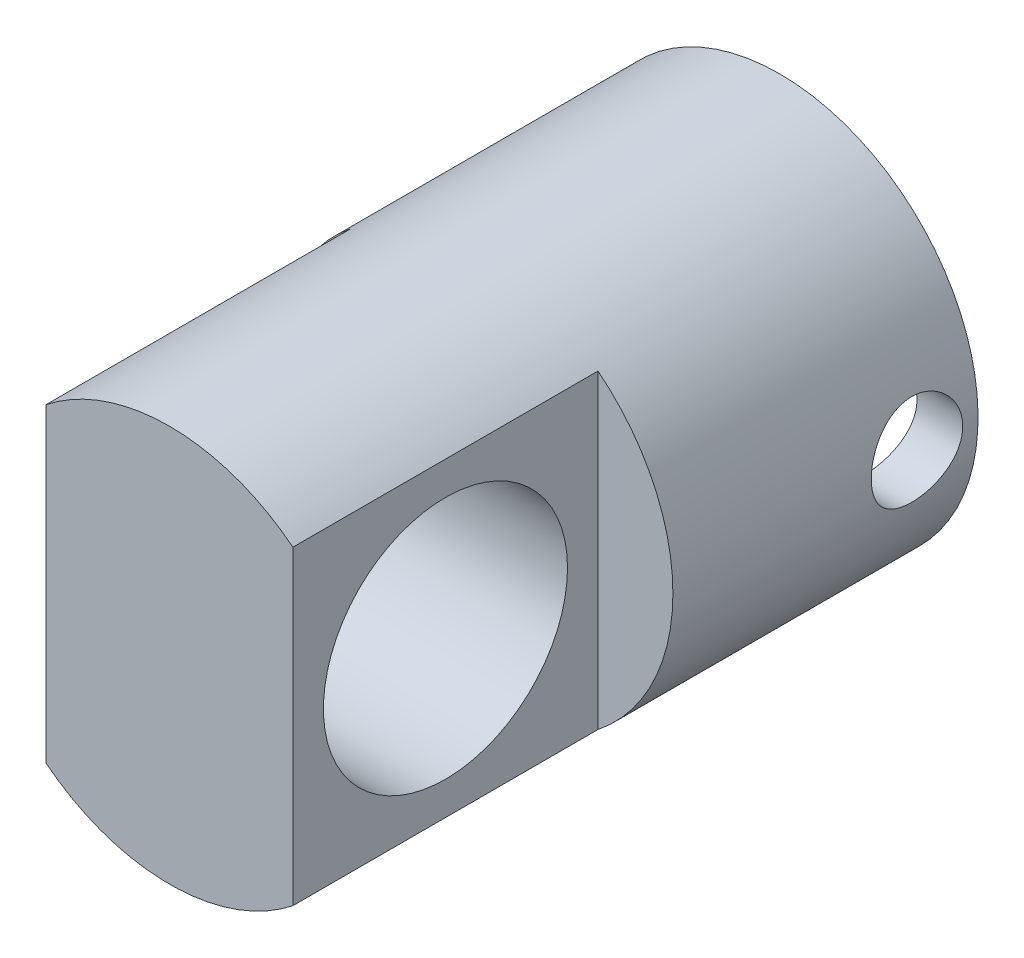
ISO-10303-21;
HEADER;
FILE_DESCRIPTION(('STEP AP214'),'2;1');
FILE_NAME('part.step','',(''),(''),'','','');
FILE_SCHEMA(('AUTOMOTIVE_DESIGN { 1 0 10303 214 1 1 1 1 }'));
ENDSEC;
DATA;
#1=APPLICATION_CONTEXT('core data for automotive mechanical design processes');
#2=APPLICATION_PROTOCOL_DEFINITION('international standard','automotive_design',2000,#1);
#3=PRODUCT_CONTEXT('',#1,'mechanical');
#4=PRODUCT('Part','Part','',(#3));
#5=PRODUCT_RELATED_PRODUCT_CATEGORY('part','',(#4));
#6=PRODUCT_DEFINITION_FORMATION('','',#4);
#7=PRODUCT_DEFINITION_CONTEXT('part definition',#1,'design');
#8=PRODUCT_DEFINITION('design','',#6,#7);
#9=PRODUCT_DEFINITION_SHAPE('','',#8);
#10=(LENGTH_UNIT() NAMED_UNIT(*) SI_UNIT(.MILLI.,.METRE.));
#11=(NAMED_UNIT(*) PLANE_ANGLE_UNIT() SI_UNIT($,.RADIAN.));
#12=(NAMED_UNIT(*) SI_UNIT($,.STERADIAN.) SOLID_ANGLE_UNIT());
#13=UNCERTAINTY_MEASURE_WITH_UNIT(LENGTH_MEASURE(1.E-05),#10,'distance_accuracy_value','');
#14=(GEOMETRIC_REPRESENTATION_CONTEXT(3) GLOBAL_UNCERTAINTY_ASSIGNED_CONTEXT((#13)) GLOBAL_UNIT_ASSIGNED_CONTEXT((#10,
#11,#12)) REPRESENTATION_CONTEXT('',''));
#15=CARTESIAN_POINT('',(0.,0.,0.));
#16=DIRECTION('',(0.,0.,1.));
#17=DIRECTION('',(1.,0.,0.));
#18=AXIS2_PLACEMENT_3D('',#15,#16,#17);
#19=CARTESIAN_POINT('',(0.,13.,-25.));
#20=DIRECTION('',(0.,0.,-1.));
#21=DIRECTION('',(0.,1.,0.));
#22=AXIS2_PLACEMENT_3D('',#19,#20,#21);
#23=CYLINDRICAL_SURFACE('',#22,13.);
#24=CARTESIAN_POINT('',(0.,13.,0.));
#25=DIRECTION('',(0.,0.,-1.));
#26=DIRECTION('',(0.,1.,0.));
#27=AXIS2_PLACEMENT_3D('',#24,#25,#26);
#28=CIRCLE('',#27,13.);
#29=CARTESIAN_POINT('',(-8.09151168124387,23.1748434244608,0.));
#30=VERTEX_POINT('',#29);
#31=CARTESIAN_POINT('',(8.09151168124387,23.1748434244608,0.));
#32=VERTEX_POINT('',#31);
#33=EDGE_CURVE('E49',#30,#32,#28,.T.);
#34=ORIENTED_EDGE('',*,*,#33,.T.);
#35=DIRECTION('',(0.,0.,1.));
#36=VECTOR('',#35,1.);
#37=CARTESIAN_POINT('',(8.09151168124387,23.1748434244608,-20.));
#38=LINE('',#37,#36);
#39=CARTESIAN_POINT('',(8.09151168124387,23.1748434244608,-20.));
#40=VERTEX_POINT('',#39);
#41=EDGE_CURVE('E65',#40,#32,#38,.T.);
#42=ORIENTED_EDGE('',*,*,#41,.F.);
#43=CARTESIAN_POINT('',(0.,13.,-20.));
#44=DIRECTION('',(0.,0.,1.));
#45=DIRECTION('',(1.,0.,0.));
#46=AXIS2_PLACEMENT_3D('',#43,#44,#45);
#47=CIRCLE('',#46,13.);
#48=CARTESIAN_POINT('',(8.09151168124387,2.82515657553916,-20.));
#49=VERTEX_POINT('',#48);
#50=EDGE_CURVE('E84',#49,#40,#47,.T.);
#51=ORIENTED_EDGE('',*,*,#50,.F.);
#52=DIRECTION('',(0.,0.,1.));
#53=VECTOR('',#52,1.);
#54=CARTESIAN_POINT('',(8.09151168124387,2.82515657553916,-20.));
#55=LINE('',#54,#53);
#56=CARTESIAN_POINT('',(8.09151168124387,2.82515657553916,0.));
#57=VERTEX_POINT('',#56);
#58=EDGE_CURVE('E92',#49,#57,#55,.T.);
#59=ORIENTED_EDGE('',*,*,#58,.T.);
#60=CARTESIAN_POINT('',(-8.09151168124387,2.82515657553916,0.));
#61=VERTEX_POINT('',#60);
#62=EDGE_CURVE('E11',#57,#61,#28,.T.);
#63=ORIENTED_EDGE('',*,*,#62,.T.);
#64=DIRECTION('',(0.,0.,1.));
#65=VECTOR('',#64,1.);
#66=CARTESIAN_POINT('',(-8.09151168124387,2.82515657553916,-20.));
#67=LINE('',#66,#65);
#68=CARTESIAN_POINT('',(-8.09151168124387,2.82515657553916,-20.));
#69=VERTEX_POINT('',#68);
#70=EDGE_CURVE('E57',#69,#61,#67,.T.);
#71=ORIENTED_EDGE('',*,*,#70,.F.);
#72=CARTESIAN_POINT('',(0.,13.,-20.));
#73=DIRECTION('',(0.,0.,1.));
#74=DIRECTION('',(1.,0.,0.));
#75=AXIS2_PLACEMENT_3D('',#72,#73,#74);
#76=CIRCLE('',#75,13.);
#77=CARTESIAN_POINT('',(-8.09151168124387,23.1748434244608,-20.));
#78=VERTEX_POINT('',#77);
#79=EDGE_CURVE('E105',#78,#69,#76,.T.);
#80=ORIENTED_EDGE('',*,*,#79,.F.);
#81=DIRECTION('',(0.,0.,1.));
#82=VECTOR('',#81,1.);
#83=CARTESIAN_POINT('',(-8.09151168124387,23.1748434244608,-20.));
#84=LINE('',#83,#82);
#85=EDGE_CURVE('E109',#78,#30,#84,.T.);
#86=ORIENTED_EDGE('',*,*,#85,.T.);
#87=EDGE_LOOP('',(#34,#42,#51,#59,#63,#71,#80,#86));
#88=FACE_BOUND('',#87,.T.);
#89=CARTESIAN_POINT('',(0.,13.,-40.));
#90=DIRECTION('',(0.,0.,-1.));
#91=DIRECTION('',(0.,1.,0.));
#92=AXIS2_PLACEMENT_3D('',#89,#90,#91);
#93=CIRCLE('',#92,13.);
#94=CARTESIAN_POINT('',(0.,26.,-40.));
#95=VERTEX_POINT('',#94);
#96=EDGE_CURVE('E119',#95,#95,#93,.T.);
#97=ORIENTED_EDGE('',*,*,#96,.F.);
#98=EDGE_LOOP('',(#97));
#99=FACE_BOUND('',#98,.T.);
#100=CARTESIAN_POINT('',(-13.,13.,-33.));
#101=CARTESIAN_POINT('',(-12.9999969906573,13.1661523449527,-33.0000053307118));
#102=CARTESIAN_POINT('',(-12.9967824842909,13.3323672059736,-33.0138498536222));
#103=CARTESIAN_POINT('',(-12.9842700075106,13.6600598664932,-33.0687952857713));
#104=CARTESIAN_POINT('',(-12.9749680237034,13.8215344673667,-33.1099141768828));
#105=CARTESIAN_POINT('',(-12.9513142129353,14.1349648012989,-33.2180393978818));
#106=CARTESIAN_POINT('',(-12.936967958219,14.2869308208639,-33.2850171702627));
#107=CARTESIAN_POINT('',(-12.904766336637,14.577465910561,-33.4428645301367));
#108=CARTESIAN_POINT('',(-12.8869109815535,14.7160350256719,-33.5337340374119));
#109=CARTESIAN_POINT('',(-12.8492864660987,14.9783047062464,-33.7384905033544));
#110=CARTESIAN_POINT('',(-12.8294913730763,15.1017335843224,-33.8527207234048));
#111=CARTESIAN_POINT('',(-12.7903971901517,15.3278612079539,-34.1002198531428));
#112=CARTESIAN_POINT('',(-12.7710981487534,15.4305579329983,-34.2334906163216));
#113=CARTESIAN_POINT('',(-12.7349234835873,15.6135339150511,-34.51733385512));
#114=CARTESIAN_POINT('',(-12.7180809816988,15.6935185095554,-34.6681008819513));
#115=CARTESIAN_POINT('',(-12.6891009206901,15.8269079066015,-34.9813901973035));
#116=CARTESIAN_POINT('',(-12.6769627300499,15.8803162770841,-35.1439109044991));
#117=CARTESIAN_POINT('',(-12.659030692131,15.9581284851719,-35.4731316031644));
#118=CARTESIAN_POINT('',(-12.6531311408672,15.9830161899359,-35.6397113467331));
#119=CARTESIAN_POINT('',(-12.6480272975283,16.0045861409287,-35.9747781740706));
#120=CARTESIAN_POINT('',(-12.6488220853967,16.0012722631264,-36.1432649925563));
#121=CARTESIAN_POINT('',(-12.6569216667427,15.9669212657146,-36.4737256156487));
#122=CARTESIAN_POINT('',(-12.6640932250769,15.9364515063037,-36.6357621626882));
#123=CARTESIAN_POINT('',(-12.683927027642,15.8495548295868,-36.9523595838029));
#124=CARTESIAN_POINT('',(-12.6965896109567,15.7931263092534,-37.1069199955541));
#125=CARTESIAN_POINT('',(-12.726106644567,15.655406981501,-37.4057453432819));
#126=CARTESIAN_POINT('',(-12.7429968648251,15.5739025849305,-37.549908161822));
#127=CARTESIAN_POINT('',(-12.7790447936328,15.3884949795051,-37.8227184725787));
#128=CARTESIAN_POINT('',(-12.7982028439228,15.2845883929106,-37.951363620518));
#129=CARTESIAN_POINT('',(-12.8371955528176,15.054346421729,-38.1927479001019));
#130=CARTESIAN_POINT('',(-12.8570353769547,14.9275299016901,-38.3050277702499));
#131=CARTESIAN_POINT('',(-12.8947363213875,14.6566372821068,-38.5068061419507));
#132=CARTESIAN_POINT('',(-12.91259739752,14.51256079749,-38.5963041350972));
#133=CARTESIAN_POINT('',(-12.94439708166,14.2106425559447,-38.7501118282866));
#134=CARTESIAN_POINT('',(-12.9583254640484,14.0527662865885,-38.8143560313853));
#135=CARTESIAN_POINT('',(-12.980615159728,13.7280647925052,-38.9152722873901));
#136=CARTESIAN_POINT('',(-12.9889773764326,13.5612410247485,-38.9519488147769));
#137=CARTESIAN_POINT('',(-12.999062058904,13.2273146478633,-38.9960083006963));
#138=CARTESIAN_POINT('',(-13.0009265305377,13.0602988900254,-39.0040178721195));
#139=CARTESIAN_POINT('',(-12.9982059982626,12.7273152568415,-38.9922219704814));
#140=CARTESIAN_POINT('',(-12.9936214841662,12.5613473028745,-38.972418609864));
#141=CARTESIAN_POINT('',(-12.9786082469926,12.2372841924039,-38.9060776067885));
#142=CARTESIAN_POINT('',(-12.968252478837,12.0791170702486,-38.8598735173657));
#143=CARTESIAN_POINT('',(-12.9428582085761,11.7727807550367,-38.7424168221512));
#144=CARTESIAN_POINT('',(-12.9278192778858,11.6246124785468,-38.6711619237282));
#145=CARTESIAN_POINT('',(-12.8943799217624,11.3399247697796,-38.5043547121581));
#146=CARTESIAN_POINT('',(-12.8759307059183,11.2036231794074,-38.4084406162299));
#147=CARTESIAN_POINT('',(-12.837807838285,10.9488256390363,-38.1955087652826));
#148=CARTESIAN_POINT('',(-12.8181340084537,10.8303322867044,-38.0784879369158));
#149=CARTESIAN_POINT('',(-12.7792809496474,10.61199794334,-37.8237752282431));
#150=CARTESIAN_POINT('',(-12.7601203499969,10.5125931282204,-37.6857060706494));
#151=CARTESIAN_POINT('',(-12.7249237700036,10.3383752910705,-37.3944682395653));
#152=CARTESIAN_POINT('',(-12.7088876507294,10.2635611755028,-37.2413002379075));
#153=CARTESIAN_POINT('',(-12.6819190230073,10.1411786626399,-36.9250480231647));
#154=CARTESIAN_POINT('',(-12.6709569224205,10.0934519103925,-36.762027740679));
#155=CARTESIAN_POINT('',(-12.6553320099168,10.0261493864882,-36.4299920143535));
#156=CARTESIAN_POINT('',(-12.6506680575041,10.0065685180124,-36.2609776616361));
#157=CARTESIAN_POINT('',(-12.6482450687886,9.99634927968086,-35.9261635458855));
#158=CARTESIAN_POINT('',(-12.6503205850391,10.0050174425696,-35.7603857787004));
#159=CARTESIAN_POINT('',(-12.6607654071459,10.0494862803833,-35.4327226426661));
#160=CARTESIAN_POINT('',(-12.6691346207273,10.0852865575119,-35.2708372167854));
#161=CARTESIAN_POINT('',(-12.6911387833219,10.1826515855969,-34.9561801784171));
#162=CARTESIAN_POINT('',(-12.7047508718617,10.2441045793285,-34.8033722785881));
#163=CARTESIAN_POINT('',(-12.7357136622436,10.390938355458,-34.5101363869175));
#164=CARTESIAN_POINT('',(-12.7530648031611,10.4763219483697,-34.3697098517453));
#165=CARTESIAN_POINT('',(-12.7900365874876,10.6708464096747,-34.1018289428198));
#166=CARTESIAN_POINT('',(-12.8096993736488,10.7804767593342,-33.9747357609008));
#167=CARTESIAN_POINT('',(-12.8488080487622,11.0194045708136,-33.7405235047234));
#168=CARTESIAN_POINT('',(-12.8682538861233,11.1487066079512,-33.6334090901394));
#169=CARTESIAN_POINT('',(-12.9050799859908,11.4256161344769,-33.4406654641024));
#170=CARTESIAN_POINT('',(-12.9224254113505,11.5734662618302,-33.3553777634204));
#171=CARTESIAN_POINT('',(-12.9527409110575,11.8817807170492,-33.2110017011828));
#172=CARTESIAN_POINT('',(-12.9657144587282,12.0422349057961,-33.1518925297941));
#173=CARTESIAN_POINT('',(-12.9836544679345,12.3355792516024,-33.0714430528885));
#174=CARTESIAN_POINT('',(-12.989744579336,12.466947265358,-33.044705457946));
#175=CARTESIAN_POINT('',(-12.9979184490222,12.7321967394383,-33.0089822667706));
#176=CARTESIAN_POINT('',(-13.0000024255872,12.8660780624203,-32.9999957033453));
#177=CARTESIAN_POINT('',(-13.,13.,-33.));
#178=B_SPLINE_CURVE_WITH_KNOTS('',3,(#100,#101,#102,#103,#104,#105,#106,#107,#108,#109,#110,
#111,#112,#113,#114,#115,#116,#117,#118,#119,#120,#121,#122,#123,#124,#125,#126,#127,#128,#129,
#130,#131,#132,#133,#134,#135,#136,#137,#138,#139,#140,#141,#142,#143,#144,#145,#146,#147,#148,
#149,#150,#151,#152,#153,#154,#155,#156,#157,#158,#159,#160,#161,#162,#163,#164,#165,#166,#167,
#168,#169,#170,#171,#172,#173,#174,#175,#176,#177),.UNSPECIFIED.,.T.,.F.,(4,2,2,2,2,2,2,2,2,2,2,
2,2,2,2,2,2,2,2,2,2,2,2,2,2,2,2,2,2,2,2,2,2,2,2,2,2,2,4),(0.,0.497966622434227,
0.996261878862196,1.49400840494549,1.9917532598344,2.49741860444443,3.00313320634928,
3.51513680218821,4.02707164139241,4.53018632285288,5.03323185836014,5.52600755521466,
6.01881368645779,6.51593939429341,7.01314010983494,7.52235052563831,8.03157230411895,
8.54210619550815,9.05255720476822,9.55178002870641,10.0509649377955,10.5439782351977,
11.0370366645577,11.5377886750691,12.0386136589455,12.5497908111456,13.0609452284513,
13.5690797726974,14.0771222894149,14.5727880288599,15.0684465012649,15.5619677862172,
16.0555470567626,16.5601864742807,17.0649434427466,17.5771721946325,18.088993031651,
18.4903854337741,18.8917559648093),.UNSPECIFIED.);
#179=CARTESIAN_POINT('',(-13.,13.,-33.));
#180=VERTEX_POINT('',#179);
#181=EDGE_CURVE('E143',#180,#180,#178,.T.);
#182=ORIENTED_EDGE('',*,*,#181,.F.);
#183=EDGE_LOOP('',(#182));
#184=FACE_BOUND('',#183,.T.);
#185=CARTESIAN_POINT('',(13.,13.,-33.));
#186=CARTESIAN_POINT('',(12.9999969906573,12.8338476550473,-33.0000053307118));
#187=CARTESIAN_POINT('',(12.9967824842909,12.6676327940263,-33.0138498536222));
#188=CARTESIAN_POINT('',(12.9842700075106,12.3399401335067,-33.0687952857713));
#189=CARTESIAN_POINT('',(12.9749680237034,12.1784655326333,-33.1099141768828));
#190=CARTESIAN_POINT('',(12.9513142129353,11.8650351987011,-33.2180393978818));
#191=CARTESIAN_POINT('',(12.936967958219,11.7130691791361,-33.2850171702627));
#192=CARTESIAN_POINT('',(12.904766336637,11.422534089439,-33.4428645301367));
#193=CARTESIAN_POINT('',(12.8869109815535,11.2839649743281,-33.5337340374119));
#194=CARTESIAN_POINT('',(12.8492864660987,11.0216952937536,-33.7384905033544));
#195=CARTESIAN_POINT('',(12.8294913730763,10.8982664156776,-33.8527207234048));
#196=CARTESIAN_POINT('',(12.7903971901517,10.6721387920461,-34.1002198531428));
#197=CARTESIAN_POINT('',(12.7710981487534,10.5694420670017,-34.2334906163216));
#198=CARTESIAN_POINT('',(12.7349234835873,10.3864660849489,-34.51733385512));
#199=CARTESIAN_POINT('',(12.7180809816988,10.3064814904445,-34.6681008819513));
#200=CARTESIAN_POINT('',(12.6891009206901,10.1730920933985,-34.9813901973035));
#201=CARTESIAN_POINT('',(12.6769627300499,10.1196837229159,-35.1439109044991));
#202=CARTESIAN_POINT('',(12.659030692131,10.0418715148281,-35.4731316031644));
#203=CARTESIAN_POINT('',(12.6531311408672,10.0169838100641,-35.6397113467331));
#204=CARTESIAN_POINT('',(12.6480272975283,9.99541385907125,-35.9747781740706));
#205=CARTESIAN_POINT('',(12.6488220853967,9.99872773687357,-36.1432649925563));
#206=CARTESIAN_POINT('',(12.6569216667427,10.0330787342853,-36.4737256156487));
#207=CARTESIAN_POINT('',(12.6640932250769,10.0635484936963,-36.6357621626882));
#208=CARTESIAN_POINT('',(12.683927027642,10.1504451704132,-36.9523595838029));
#209=CARTESIAN_POINT('',(12.6965896109567,10.2068736907466,-37.1069199955541));
#210=CARTESIAN_POINT('',(12.726106644567,10.344593018499,-37.4057453432819));
#211=CARTESIAN_POINT('',(12.7429968648251,10.4260974150694,-37.549908161822));
#212=CARTESIAN_POINT('',(12.7790447936328,10.6115050204949,-37.8227184725787));
#213=CARTESIAN_POINT('',(12.7982028439228,10.7154116070894,-37.951363620518));
#214=CARTESIAN_POINT('',(12.8371955528176,10.9456535782709,-38.1927479001019));
#215=CARTESIAN_POINT('',(12.8570353769547,11.0724700983099,-38.3050277702499));
#216=CARTESIAN_POINT('',(12.8947363213875,11.3433627178932,-38.5068061419507));
#217=CARTESIAN_POINT('',(12.91259739752,11.4874392025099,-38.5963041350972));
#218=CARTESIAN_POINT('',(12.94439708166,11.7893574440552,-38.7501118282866));
#219=CARTESIAN_POINT('',(12.9583254640484,11.9472337134115,-38.8143560313853));
#220=CARTESIAN_POINT('',(12.980615159728,12.2719352074948,-38.9152722873901));
#221=CARTESIAN_POINT('',(12.9889773764326,12.4387589752515,-38.9519488147769));
#222=CARTESIAN_POINT('',(12.999062058904,12.7726853521367,-38.9960083006963));
#223=CARTESIAN_POINT('',(13.0009265305377,12.9397011099745,-39.0040178721195));
#224=CARTESIAN_POINT('',(12.9982059982626,13.2726847431584,-38.9922219704814));
#225=CARTESIAN_POINT('',(12.9936214841662,13.4386526971255,-38.972418609864));
#226=CARTESIAN_POINT('',(12.9786082469926,13.762715807596,-38.9060776067885));
#227=CARTESIAN_POINT('',(12.968252478837,13.9208829297514,-38.8598735173657));
#228=CARTESIAN_POINT('',(12.9428582085761,14.2272192449633,-38.7424168221512));
#229=CARTESIAN_POINT('',(12.9278192778858,14.3753875214532,-38.6711619237282));
#230=CARTESIAN_POINT('',(12.8943799217624,14.6600752302203,-38.5043547121581));
#231=CARTESIAN_POINT('',(12.8759307059183,14.7963768205926,-38.4084406162299));
#232=CARTESIAN_POINT('',(12.837807838285,15.0511743609636,-38.1955087652826));
#233=CARTESIAN_POINT('',(12.8181340084537,15.1696677132956,-38.0784879369158));
#234=CARTESIAN_POINT('',(12.7792809496474,15.38800205666,-37.8237752282431));
#235=CARTESIAN_POINT('',(12.7601203499969,15.4874068717795,-37.6857060706494));
#236=CARTESIAN_POINT('',(12.7249237700036,15.6616247089294,-37.3944682395653));
#237=CARTESIAN_POINT('',(12.7088876507294,15.7364388244972,-37.2413002379075));
#238=CARTESIAN_POINT('',(12.6819190230073,15.85882133736,-36.9250480231647));
#239=CARTESIAN_POINT('',(12.6709569224205,15.9065480896074,-36.762027740679));
#240=CARTESIAN_POINT('',(12.6553320099168,15.9738506135118,-36.4299920143535));
#241=CARTESIAN_POINT('',(12.6506680575041,15.9934314819875,-36.2609776616361));
#242=CARTESIAN_POINT('',(12.6482450687886,16.0036507203191,-35.9261635458855));
#243=CARTESIAN_POINT('',(12.6503205850391,15.9949825574303,-35.7603857787004));
#244=CARTESIAN_POINT('',(12.6607654071459,15.9505137196167,-35.4327226426661));
#245=CARTESIAN_POINT('',(12.6691346207273,15.9147134424881,-35.2708372167854));
#246=CARTESIAN_POINT('',(12.6911387833219,15.8173484144031,-34.9561801784171));
#247=CARTESIAN_POINT('',(12.7047508718617,15.7558954206715,-34.8033722785881));
#248=CARTESIAN_POINT('',(12.7357136622436,15.6090616445419,-34.5101363869175));
#249=CARTESIAN_POINT('',(12.7530648031611,15.5236780516303,-34.3697098517453));
#250=CARTESIAN_POINT('',(12.7900365874876,15.3291535903253,-34.1018289428198));
#251=CARTESIAN_POINT('',(12.8096993736488,15.2195232406657,-33.9747357609008));
#252=CARTESIAN_POINT('',(12.8488080487622,14.9805954291864,-33.7405235047234));
#253=CARTESIAN_POINT('',(12.8682538861233,14.8512933920488,-33.6334090901394));
#254=CARTESIAN_POINT('',(12.9050799859908,14.5743838655231,-33.4406654641024));
#255=CARTESIAN_POINT('',(12.9224254113505,14.4265337381698,-33.3553777634204));
#256=CARTESIAN_POINT('',(12.9527409110575,14.1182192829507,-33.2110017011828));
#257=CARTESIAN_POINT('',(12.9657144587282,13.9577650942039,-33.1518925297941));
#258=CARTESIAN_POINT('',(12.9836544679345,13.6644207483975,-33.0714430528885));
#259=CARTESIAN_POINT('',(12.989744579336,13.533052734642,-33.044705457946));
#260=CARTESIAN_POINT('',(12.9979184490222,13.2678032605617,-33.0089822667706));
#261=CARTESIAN_POINT('',(13.0000024255872,13.1339219375796,-32.9999957033453));
#262=CARTESIAN_POINT('',(13.,13.,-33.));
#263=B_SPLINE_CURVE_WITH_KNOTS('',3,(#185,#186,#187,#188,#189,#190,#191,#192,#193,#194,#195,
#196,#197,#198,#199,#200,#201,#202,#203,#204,#205,#206,#207,#208,#209,#210,#211,#212,#213,#214,
#215,#216,#217,#218,#219,#220,#221,#222,#223,#224,#225,#226,#227,#228,#229,#230,#231,#232,#233,
#234,#235,#236,#237,#238,#239,#240,#241,#242,#243,#244,#245,#246,#247,#248,#249,#250,#251,#252,
#253,#254,#255,#256,#257,#258,#259,#260,#261,#262),.UNSPECIFIED.,.T.,.F.,(4,2,2,2,2,2,2,2,2,2,2,
2,2,2,2,2,2,2,2,2,2,2,2,2,2,2,2,2,2,2,2,2,2,2,2,2,2,2,4),(0.,0.497966622434227,
0.996261878862196,1.49400840494549,1.9917532598344,2.49741860444443,3.00313320634928,
3.51513680218821,4.02707164139241,4.53018632285288,5.03323185836014,5.52600755521466,
6.01881368645779,6.51593939429341,7.01314010983494,7.52235052563831,8.03157230411895,
8.54210619550815,9.05255720476822,9.55178002870642,10.0509649377955,10.5439782351977,
11.0370366645577,11.5377886750691,12.0386136589455,12.5497908111456,13.0609452284513,
13.5690797726974,14.0771222894149,14.5727880288599,15.0684465012649,15.5619677862172,
16.0555470567626,16.5601864742807,17.0649434427466,17.5771721946325,18.088993031651,
18.4903854337741,18.8917559648093),.UNSPECIFIED.);
#264=CARTESIAN_POINT('',(13.,13.,-33.));
#265=VERTEX_POINT('',#264);
#266=EDGE_CURVE('E148',#265,#265,#263,.T.);
#267=ORIENTED_EDGE('',*,*,#266,.F.);
#268=EDGE_LOOP('',(#267));
#269=FACE_BOUND('',#268,.T.);
#270=ADVANCED_FACE('F35',(#88,#99,#184,#269),#23,.T.);
#271=CARTESIAN_POINT('',(0.,13.,-25.));
#272=DIRECTION('',(0.,0.,-1.));
#273=DIRECTION('',(0.,1.,0.));
#274=AXIS2_PLACEMENT_3D('',#271,#272,#273);
#275=CYLINDRICAL_SURFACE('',#274,10.);
#276=CARTESIAN_POINT('',(0.,13.,-25.));
#277=DIRECTION('',(0.,0.,-1.));
#278=DIRECTION('',(0.,1.,0.));
#279=AXIS2_PLACEMENT_3D('',#276,#277,#278);
#280=CIRCLE('',#279,10.);
#281=CARTESIAN_POINT('',(0.,23.,-25.));
#282=VERTEX_POINT('',#281);
#283=EDGE_CURVE('E99',#282,#282,#280,.T.);
#284=ORIENTED_EDGE('',*,*,#283,.F.);
#285=EDGE_LOOP('',(#284));
#286=FACE_BOUND('',#285,.T.);
#287=CARTESIAN_POINT('',(0.,13.,-40.));
#288=DIRECTION('',(0.,0.,-1.));
#289=DIRECTION('',(0.,1.,0.));
#290=AXIS2_PLACEMENT_3D('',#287,#288,#289);
#291=CIRCLE('',#290,9.99999999999999);
#292=CARTESIAN_POINT('',(0.,23.,-40.));
#293=VERTEX_POINT('',#292);
#294=EDGE_CURVE('E116',#293,#293,#291,.T.);
#295=ORIENTED_EDGE('',*,*,#294,.T.);
#296=EDGE_LOOP('',(#295));
#297=FACE_BOUND('',#296,.T.);
#298=CARTESIAN_POINT('',(-10.,13.,-33.));
#299=CARTESIAN_POINT('',(-9.999998585011,12.8354227744934,-33.0000019949698));
#300=CARTESIAN_POINT('',(-9.99589831387907,12.6708253632969,-33.0135877272479));
#301=CARTESIAN_POINT('',(-9.97994211187381,12.3464237493902,-33.0674427084442));
#302=CARTESIAN_POINT('',(-9.96808386779384,12.1866209911771,-33.1077199160467));
#303=CARTESIAN_POINT('',(-9.93791105003672,11.8765345844909,-33.2134920338205));
#304=CARTESIAN_POINT('',(-9.9196060050085,11.7262372712092,-33.2789497392379));
#305=CARTESIAN_POINT('',(-9.8784421847529,11.4387516378937,-33.4330721861117));
#306=CARTESIAN_POINT('',(-9.85558280384133,11.3015650650606,-33.5217400147908));
#307=CARTESIAN_POINT('',(-9.80701474385548,11.0402564056325,-33.7224480149453));
#308=CARTESIAN_POINT('',(-9.78124767314072,10.9165638575113,-33.8350332517718));
#309=CARTESIAN_POINT('',(-9.73011668420884,10.6895015815335,-34.0792184598204));
#310=CARTESIAN_POINT('',(-9.70475283449002,10.5861352734512,-34.2108216242499));
#311=CARTESIAN_POINT('',(-9.65668227987544,10.4003992455258,-34.4929415060752));
#312=CARTESIAN_POINT('',(-9.63404813327749,10.3185538195557,-34.6438169219815));
#313=CARTESIAN_POINT('',(-9.59487240788062,10.1815721045048,-34.9579785084606));
#314=CARTESIAN_POINT('',(-9.57832936626621,10.1264294016005,-35.1212616878559));
#315=CARTESIAN_POINT('',(-9.55381741676868,10.045967326347,-35.4507805322609));
#316=CARTESIAN_POINT('',(-9.54562138649066,10.0198560753064,-35.6168054877279));
#317=CARTESIAN_POINT('',(-9.53805579499534,9.99572538770655,-35.9510663124335));
#318=CARTESIAN_POINT('',(-9.53868409521142,9.99769914477842,-36.1193016361182));
#319=CARTESIAN_POINT('',(-9.54849488135555,10.0290604560038,-36.446767817217));
#320=CARTESIAN_POINT('',(-9.55736777198281,10.0574558947463,-36.6061045007245));
#321=CARTESIAN_POINT('',(-9.58216712457248,10.1392515914589,-36.9176395725469));
#322=CARTESIAN_POINT('',(-9.59809428264701,10.1926543171672,-37.0698372547487));
#323=CARTESIAN_POINT('',(-9.63545466149946,10.3236794669264,-37.3652006993215));
#324=CARTESIAN_POINT('',(-9.65696032231904,10.4016236613071,-37.5082141679105));
#325=CARTESIAN_POINT('',(-9.70301974000129,10.5792955482263,-37.7794640440204));
#326=CARTESIAN_POINT('',(-9.72757423493982,10.6790285199482,-37.9076968588276));
#327=CARTESIAN_POINT('',(-9.77822022595874,10.9023741846891,-38.151372381524));
#328=CARTESIAN_POINT('',(-9.80433308620995,11.026810185066,-38.2660573280593));
#329=CARTESIAN_POINT('',(-9.85424488126517,11.2934734813721,-38.4731079681285));
#330=CARTESIAN_POINT('',(-9.8780436703682,11.4357018962782,-38.5654722568289));
#331=CARTESIAN_POINT('',(-9.9208632013894,11.7352899233144,-38.7257198449295));
#332=CARTESIAN_POINT('',(-9.93985087336628,11.8927445005041,-38.7934350324997));
#333=CARTESIAN_POINT('',(-9.97067043664443,12.2175091687929,-38.9011991801993));
#334=CARTESIAN_POINT('',(-9.98250432373998,12.3848164968208,-38.941255857065));
#335=CARTESIAN_POINT('',(-9.99736729287076,12.7180955146633,-38.9913043557988));
#336=CARTESIAN_POINT('',(-10.0006970083558,12.8838998047976,-39.0023231716032));
#337=CARTESIAN_POINT('',(-9.99905846483519,13.2149992116467,-38.9968616885758));
#338=CARTESIAN_POINT('',(-9.99409131355514,13.3802943933815,-38.9803850606971));
#339=CARTESIAN_POINT('',(-9.97661393974324,13.7018072106194,-38.921230777777));
#340=CARTESIAN_POINT('',(-9.96427659598828,13.8581455452283,-38.8791532248383));
#341=CARTESIAN_POINT('',(-9.93348695683069,14.161509277909,-38.7707135344436));
#342=CARTESIAN_POINT('',(-9.91503392642187,14.3085335540512,-38.7043484779243));
#343=CARTESIAN_POINT('',(-9.8733930870263,14.5928743789221,-38.5474936690377));
#344=CARTESIAN_POINT('',(-9.8501056165928,14.7298876523993,-38.456481318104));
#345=CARTESIAN_POINT('',(-9.80146937528704,14.9870466159603,-38.2535504918944));
#346=CARTESIAN_POINT('',(-9.77612008862419,15.1071880647119,-38.1416267762247));
#347=CARTESIAN_POINT('',(-9.72506343738006,15.3317148910205,-37.8952253832613));
#348=CARTESIAN_POINT('',(-9.69937650065513,15.43536962463,-37.7600762484564));
#349=CARTESIAN_POINT('',(-9.65153030477949,15.6185799014431,-37.4737441219731));
#350=CARTESIAN_POINT('',(-9.62937095313121,15.6981360765896,-37.3225615508842));
#351=CARTESIAN_POINT('',(-9.59134379226309,15.8303469425431,-37.00893501749));
#352=CARTESIAN_POINT('',(-9.575446756735,15.8831269387402,-36.8465476269243));
#353=CARTESIAN_POINT('',(-9.55183188739737,15.960434616303,-36.5146240621395));
#354=CARTESIAN_POINT('',(-9.54411125069387,15.9849719795785,-36.3450903584339));
#355=CARTESIAN_POINT('',(-9.53799944941558,16.0044396896993,-36.0112769632232));
#356=CARTESIAN_POINT('',(-9.53923294700394,16.0005611061589,-35.8470726979012));
#357=CARTESIAN_POINT('',(-9.54998802392188,15.9661501088861,-35.5217717931988));
#358=CARTESIAN_POINT('',(-9.55950927135901,15.9356187624941,-35.360675029639));
#359=CARTESIAN_POINT('',(-9.58551527389243,15.8495377760868,-35.0481092017367));
#360=CARTESIAN_POINT('',(-9.60191209104934,15.7943035101425,-34.8965454252826));
#361=CARTESIAN_POINT('',(-9.63980557805265,15.6606301424215,-34.6047151223586));
#362=CARTESIAN_POINT('',(-9.6613032238508,15.5821865992572,-34.4644507647169));
#363=CARTESIAN_POINT('',(-9.70795352855338,15.4009752761017,-34.1936737669475));
#364=CARTESIAN_POINT('',(-9.7332108032858,15.2974255218599,-34.0637024774796));
#365=CARTESIAN_POINT('',(-9.78402640899066,15.0703486925955,-33.8225950033838));
#366=CARTESIAN_POINT('',(-9.80958481647542,14.946816434269,-33.7114637210644));
#367=CARTESIAN_POINT('',(-9.85901873141573,14.6789315243665,-33.5079531754101));
#368=CARTESIAN_POINT('',(-9.88282319531421,14.5340757715812,-33.4162171062891));
#369=CARTESIAN_POINT('',(-9.92521360911552,14.230282747967,-33.2585296601919));
#370=CARTESIAN_POINT('',(-9.94380199862114,14.0713521059979,-33.192566223451));
#371=CARTESIAN_POINT('',(-9.97204349938618,13.7615154253106,-33.0942094486945));
#372=CARTESIAN_POINT('',(-9.98244054762139,13.6115739239085,-33.0589766542335));
#373=CARTESIAN_POINT('',(-9.9964188898898,13.3077603904615,-33.0118729495168));
#374=CARTESIAN_POINT('',(-10.0000013230948,13.1538890197163,-32.9999981345904));
#375=CARTESIAN_POINT('',(-10.,13.,-33.));
#376=B_SPLINE_CURVE_WITH_KNOTS('',3,(#298,#299,#300,#301,#302,#303,#304,#305,#306,#307,#308,
#309,#310,#311,#312,#313,#314,#315,#316,#317,#318,#319,#320,#321,#322,#323,#324,#325,#326,#327,
#328,#329,#330,#331,#332,#333,#334,#335,#336,#337,#338,#339,#340,#341,#342,#343,#344,#345,#346,
#347,#348,#349,#350,#351,#352,#353,#354,#355,#356,#357,#358,#359,#360,#361,#362,#363,#364,#365,
#366,#367,#368,#369,#370,#371,#372,#373,#374,#375),.UNSPECIFIED.,.T.,.F.,(4,2,2,2,2,2,2,2,2,2,2,
2,2,2,2,2,2,2,2,2,2,2,2,2,2,2,2,2,2,2,2,2,2,2,2,2,2,2,4),(0.,0.49316640722522,0.986479929691998,
1.47906735260175,1.9717203288254,2.47711205896382,2.98258874577266,3.49942962008218,
4.01614629086447,4.51839378713198,5.02051956638179,5.50452033395352,5.98856887316003,
6.47924852894239,6.97004720317111,7.48134208096334,7.99266913062143,8.50742093763377,
9.02202907057615,9.5181761887709,10.0142570710065,10.4991349336465,10.9840710918746,
11.4802261140582,11.9765056400038,12.4908080064564,13.0050968850536,13.516956299025,
14.0286401892057,14.5190031093854,15.0093463933232,15.4936008081456,15.9779479511533,
16.4799385136898,16.9820594980412,17.4988599232246,18.0154182319959,18.4766338387004,
18.9377723390687),.UNSPECIFIED.);
#377=CARTESIAN_POINT('',(-10.,13.,-33.));
#378=VERTEX_POINT('',#377);
#379=EDGE_CURVE('E121',#378,#378,#376,.T.);
#380=ORIENTED_EDGE('',*,*,#379,.F.);
#381=EDGE_LOOP('',(#380));
#382=FACE_BOUND('',#381,.T.);
#383=CARTESIAN_POINT('',(10.,13.,-33.));
#384=CARTESIAN_POINT('',(9.999998585011,13.1645772255066,-33.0000019949698));
#385=CARTESIAN_POINT('',(9.99589831387907,13.329174636703,-33.0135877272479));
#386=CARTESIAN_POINT('',(9.97994211187381,13.6535762506097,-33.0674427084442));
#387=CARTESIAN_POINT('',(9.96808386779384,13.8133790088228,-33.1077199160467));
#388=CARTESIAN_POINT('',(9.93791105003672,14.123465415509,-33.2134920338205));
#389=CARTESIAN_POINT('',(9.9196060050085,14.2737627287907,-33.2789497392379));
#390=CARTESIAN_POINT('',(9.8784421847529,14.5612483621062,-33.4330721861117));
#391=CARTESIAN_POINT('',(9.85558280384133,14.6984349349393,-33.5217400147908));
#392=CARTESIAN_POINT('',(9.80701474385548,14.9597435943675,-33.7224480149453));
#393=CARTESIAN_POINT('',(9.78124767314072,15.0834361424887,-33.8350332517718));
#394=CARTESIAN_POINT('',(9.73011668420884,15.3104984184665,-34.0792184598204));
#395=CARTESIAN_POINT('',(9.70475283449002,15.4138647265488,-34.2108216242499));
#396=CARTESIAN_POINT('',(9.65668227987544,15.5996007544741,-34.4929415060752));
#397=CARTESIAN_POINT('',(9.63404813327749,15.6814461804443,-34.6438169219815));
#398=CARTESIAN_POINT('',(9.59487240788062,15.8184278954952,-34.9579785084606));
#399=CARTESIAN_POINT('',(9.57832936626621,15.8735705983995,-35.1212616878559));
#400=CARTESIAN_POINT('',(9.55381741676868,15.954032673653,-35.4507805322609));
#401=CARTESIAN_POINT('',(9.54562138649066,15.9801439246935,-35.6168054877279));
#402=CARTESIAN_POINT('',(9.53805579499534,16.0042746122934,-35.9510663124335));
#403=CARTESIAN_POINT('',(9.53868409521142,16.0023008552216,-36.1193016361182));
#404=CARTESIAN_POINT('',(9.54849488135555,15.9709395439962,-36.446767817217));
#405=CARTESIAN_POINT('',(9.55736777198281,15.9425441052537,-36.6061045007245));
#406=CARTESIAN_POINT('',(9.58216712457248,15.8607484085411,-36.9176395725469));
#407=CARTESIAN_POINT('',(9.59809428264701,15.8073456828328,-37.0698372547487));
#408=CARTESIAN_POINT('',(9.63545466149946,15.6763205330736,-37.3652006993215));
#409=CARTESIAN_POINT('',(9.65696032231904,15.5983763386928,-37.5082141679105));
#410=CARTESIAN_POINT('',(9.70301974000129,15.4207044517737,-37.7794640440204));
#411=CARTESIAN_POINT('',(9.72757423493982,15.3209714800518,-37.9076968588276));
#412=CARTESIAN_POINT('',(9.77822022595874,15.0976258153109,-38.151372381524));
#413=CARTESIAN_POINT('',(9.80433308620995,14.9731898149339,-38.2660573280593));
#414=CARTESIAN_POINT('',(9.85424488126517,14.7065265186279,-38.4731079681285));
#415=CARTESIAN_POINT('',(9.8780436703682,14.5642981037218,-38.5654722568289));
#416=CARTESIAN_POINT('',(9.9208632013894,14.2647100766856,-38.7257198449295));
#417=CARTESIAN_POINT('',(9.93985087336628,14.1072554994959,-38.7934350324997));
#418=CARTESIAN_POINT('',(9.97067043664443,13.782490831207,-38.9011991801993));
#419=CARTESIAN_POINT('',(9.98250432373998,13.6151835031792,-38.941255857065));
#420=CARTESIAN_POINT('',(9.99736729287076,13.2819044853367,-38.9913043557988));
#421=CARTESIAN_POINT('',(10.0006970083558,13.1161001952024,-39.0023231716032));
#422=CARTESIAN_POINT('',(9.99905846483519,12.7850007883532,-38.9968616885758));
#423=CARTESIAN_POINT('',(9.99409131355514,12.6197056066184,-38.9803850606971));
#424=CARTESIAN_POINT('',(9.97661393974324,12.2981927893806,-38.921230777777));
#425=CARTESIAN_POINT('',(9.96427659598828,12.1418544547717,-38.8791532248383));
#426=CARTESIAN_POINT('',(9.93348695683069,11.8384907220909,-38.7707135344436));
#427=CARTESIAN_POINT('',(9.91503392642187,11.6914664459488,-38.7043484779243));
#428=CARTESIAN_POINT('',(9.87339308702631,11.4071256210779,-38.5474936690377));
#429=CARTESIAN_POINT('',(9.8501056165928,11.2701123476007,-38.456481318104));
#430=CARTESIAN_POINT('',(9.80146937528704,11.0129533840397,-38.2535504918944));
#431=CARTESIAN_POINT('',(9.77612008862419,10.8928119352881,-38.1416267762247));
#432=CARTESIAN_POINT('',(9.72506343738006,10.6682851089795,-37.8952253832613));
#433=CARTESIAN_POINT('',(9.69937650065513,10.56463037537,-37.7600762484564));
#434=CARTESIAN_POINT('',(9.65153030477949,10.3814200985569,-37.4737441219731));
#435=CARTESIAN_POINT('',(9.62937095313121,10.3018639234103,-37.3225615508842));
#436=CARTESIAN_POINT('',(9.59134379226309,10.1696530574568,-37.00893501749));
#437=CARTESIAN_POINT('',(9.575446756735,10.1168730612598,-36.8465476269243));
#438=CARTESIAN_POINT('',(9.55183188739736,10.0395653836969,-36.5146240621395));
#439=CARTESIAN_POINT('',(9.54411125069387,10.0150280204215,-36.3450903584339));
#440=CARTESIAN_POINT('',(9.53799944941558,9.99556031030068,-36.0112769632232));
#441=CARTESIAN_POINT('',(9.53923294700394,9.99943889384112,-35.8470726979012));
#442=CARTESIAN_POINT('',(9.54998802392188,10.0338498911139,-35.5217717931988));
#443=CARTESIAN_POINT('',(9.55950927135901,10.0643812375059,-35.360675029639));
#444=CARTESIAN_POINT('',(9.58551527389243,10.1504622239131,-35.0481092017367));
#445=CARTESIAN_POINT('',(9.60191209104933,10.2056964898575,-34.8965454252826));
#446=CARTESIAN_POINT('',(9.63980557805265,10.3393698575785,-34.6047151223585));
#447=CARTESIAN_POINT('',(9.6613032238508,10.4178134007428,-34.4644507647168));
#448=CARTESIAN_POINT('',(9.70795352855338,10.5990247238982,-34.1936737669475));
#449=CARTESIAN_POINT('',(9.7332108032858,10.70257447814,-34.0637024774796));
#450=CARTESIAN_POINT('',(9.78402640899066,10.9296513074044,-33.8225950033838));
#451=CARTESIAN_POINT('',(9.80958481647542,11.053183565731,-33.7114637210644));
#452=CARTESIAN_POINT('',(9.85901873141573,11.3210684756335,-33.5079531754101));
#453=CARTESIAN_POINT('',(9.88282319531421,11.4659242284188,-33.4162171062891));
#454=CARTESIAN_POINT('',(9.92521360911552,11.7697172520329,-33.2585296601919));
#455=CARTESIAN_POINT('',(9.94380199862114,11.9286478940021,-33.192566223451));
#456=CARTESIAN_POINT('',(9.97204349938618,12.2384845746894,-33.0942094486945));
#457=CARTESIAN_POINT('',(9.98244054762139,12.3884260760915,-33.0589766542335));
#458=CARTESIAN_POINT('',(9.9964188898898,12.6922396095384,-33.0118729495168));
#459=CARTESIAN_POINT('',(10.0000013230948,12.8461109802837,-32.9999981345904));
#460=CARTESIAN_POINT('',(10.,13.,-33.));
#461=B_SPLINE_CURVE_WITH_KNOTS('',3,(#383,#384,#385,#386,#387,#388,#389,#390,#391,#392,#393,
#394,#395,#396,#397,#398,#399,#400,#401,#402,#403,#404,#405,#406,#407,#408,#409,#410,#411,#412,
#413,#414,#415,#416,#417,#418,#419,#420,#421,#422,#423,#424,#425,#426,#427,#428,#429,#430,#431,
#432,#433,#434,#435,#436,#437,#438,#439,#440,#441,#442,#443,#444,#445,#446,#447,#448,#449,#450,
#451,#452,#453,#454,#455,#456,#457,#458,#459,#460),.UNSPECIFIED.,.T.,.F.,(4,2,2,2,2,2,2,2,2,2,2,
2,2,2,2,2,2,2,2,2,2,2,2,2,2,2,2,2,2,2,2,2,2,2,2,2,2,2,4),(0.,0.49316640722522,0.986479929691998,
1.47906735260175,1.9717203288254,2.47711205896382,2.98258874577266,3.49942962008218,
4.01614629086447,4.51839378713198,5.02051956638178,5.50452033395352,5.98856887316003,
6.47924852894239,6.97004720317111,7.48134208096333,7.99266913062143,8.50742093763377,
9.02202907057615,9.5181761887709,10.0142570710065,10.4991349336465,10.9840710918746,
11.4802261140582,11.9765056400038,12.4908080064564,13.0050968850536,13.516956299025,
14.0286401892057,14.5190031093854,15.0093463933232,15.4936008081456,15.9779479511534,
16.4799385136898,16.9820594980412,17.4988599232246,18.0154182319959,18.4766338387004,
18.9377723390687),.UNSPECIFIED.);
#462=CARTESIAN_POINT('',(10.,13.,-33.));
#463=VERTEX_POINT('',#462);
#464=EDGE_CURVE('E39',#463,#463,#461,.T.);
#465=ORIENTED_EDGE('',*,*,#464,.F.);
#466=EDGE_LOOP('',(#465));
#467=FACE_BOUND('',#466,.T.);
#468=ADVANCED_FACE('F126',(#286,#297,#382,#467),#275,.F.);
#469=CARTESIAN_POINT('',(0.,0.,0.));
#470=DIRECTION('',(0.,0.,-1.));
#471=DIRECTION('',(0.,1.,0.));
#472=AXIS2_PLACEMENT_3D('',#469,#470,#471);
#473=PLANE('',#472);
#474=ORIENTED_EDGE('',*,*,#62,.F.);
#475=DIRECTION('',(0.,-1.,0.));
#476=VECTOR('',#475,1.);
#477=CARTESIAN_POINT('',(8.09151168124387,0.,0.));
#478=LINE('',#477,#476);
#479=EDGE_CURVE('E89',#32,#57,#478,.T.);
#480=ORIENTED_EDGE('',*,*,#479,.F.);
#481=ORIENTED_EDGE('',*,*,#33,.F.);
#482=DIRECTION('',(0.,-1.,0.));
#483=VECTOR('',#482,1.);
#484=CARTESIAN_POINT('',(-8.09151168124387,0.,0.));
#485=LINE('',#484,#483);
#486=EDGE_CURVE('E106',#30,#61,#485,.T.);
#487=ORIENTED_EDGE('',*,*,#486,.T.);
#488=EDGE_LOOP('',(#474,#480,#481,#487));
#489=FACE_BOUND('',#488,.T.);
#490=ADVANCED_FACE('F37',(#489),#473,.F.);
#491=CARTESIAN_POINT('',(0.,0.,-25.));
#492=DIRECTION('',(0.,0.,1.));
#493=DIRECTION('',(0.,-1.,0.));
#494=AXIS2_PLACEMENT_3D('',#491,#492,#493);
#495=PLANE('',#494);
#496=ORIENTED_EDGE('',*,*,#283,.T.);
#497=EDGE_LOOP('',(#496));
#498=FACE_BOUND('',#497,.T.);
#499=ADVANCED_FACE('F159',(#498),#495,.F.);
#500=CARTESIAN_POINT('',(0.,0.,-40.));
#501=DIRECTION('',(0.,0.,1.));
#502=DIRECTION('',(0.,-1.,0.));
#503=AXIS2_PLACEMENT_3D('',#500,#501,#502);
#504=PLANE('',#503);
#505=ORIENTED_EDGE('',*,*,#294,.F.);
#506=EDGE_LOOP('',(#505));
#507=FACE_BOUND('',#506,.T.);
#508=ORIENTED_EDGE('',*,*,#96,.T.);
#509=EDGE_LOOP('',(#508));
#510=FACE_BOUND('',#509,.T.);
#511=ADVANCED_FACE('F155',(#507,#510),#504,.F.);
#512=CARTESIAN_POINT('',(-8.09151168124387,0.,-20.));
#513=DIRECTION('',(-1.,0.,0.));
#514=DIRECTION('',(0.,0.,1.));
#515=AXIS2_PLACEMENT_3D('',#512,#513,#514);
#516=PLANE('',#515);
#517=CARTESIAN_POINT('',(-8.09151168124387,13.,-10.));
#518=DIRECTION('',(-1.,0.,0.));
#519=DIRECTION('',(0.,0.,1.));
#520=AXIS2_PLACEMENT_3D('',#517,#518,#519);
#521=CIRCLE('',#520,8.);
#522=CARTESIAN_POINT('',(-8.09151168124387,13.,-2.));
#523=VERTEX_POINT('',#522);
#524=EDGE_CURVE('E111',#523,#523,#521,.T.);
#525=ORIENTED_EDGE('',*,*,#524,.F.);
#526=EDGE_LOOP('',(#525));
#527=FACE_BOUND('',#526,.T.);
#528=ORIENTED_EDGE('',*,*,#486,.F.);
#529=ORIENTED_EDGE('',*,*,#85,.F.);
#530=DIRECTION('',(0.,-1.,0.));
#531=VECTOR('',#530,1.);
#532=CARTESIAN_POINT('',(-8.09151168124387,0.,-20.));
#533=LINE('',#532,#531);
#534=EDGE_CURVE('E103',#78,#69,#533,.T.);
#535=ORIENTED_EDGE('',*,*,#534,.T.);
#536=ORIENTED_EDGE('',*,*,#70,.T.);
#537=EDGE_LOOP('',(#528,#529,#535,#536));
#538=FACE_BOUND('',#537,.T.);
#539=ADVANCED_FACE('F158',(#527,#538),#516,.T.);
#540=CARTESIAN_POINT('',(0.,0.,-20.));
#541=DIRECTION('',(0.,0.,1.));
#542=DIRECTION('',(1.,0.,0.));
#543=AXIS2_PLACEMENT_3D('',#540,#541,#542);
#544=PLANE('',#543);
#545=ORIENTED_EDGE('',*,*,#534,.F.);
#546=ORIENTED_EDGE('',*,*,#79,.T.);
#547=EDGE_LOOP('',(#545,#546));
#548=FACE_BOUND('',#547,.T.);
#549=ADVANCED_FACE('F165',(#548),#544,.T.);
#550=CARTESIAN_POINT('',(8.09151168124387,0.,-20.));
#551=DIRECTION('',(-1.,0.,0.));
#552=DIRECTION('',(0.,0.,1.));
#553=AXIS2_PLACEMENT_3D('',#550,#551,#552);
#554=PLANE('',#553);
#555=CARTESIAN_POINT('',(8.09151168124387,13.,-10.));
#556=DIRECTION('',(1.,0.,0.));
#557=DIRECTION('',(0.,0.,-1.));
#558=AXIS2_PLACEMENT_3D('',#555,#556,#557);
#559=CIRCLE('',#558,8.);
#560=CARTESIAN_POINT('',(8.09151168124387,13.,-18.));
#561=VERTEX_POINT('',#560);
#562=EDGE_CURVE('E178',#561,#561,#559,.T.);
#563=ORIENTED_EDGE('',*,*,#562,.F.);
#564=EDGE_LOOP('',(#563));
#565=FACE_BOUND('',#564,.T.);
#566=ORIENTED_EDGE('',*,*,#479,.T.);
#567=ORIENTED_EDGE('',*,*,#58,.F.);
#568=DIRECTION('',(0.,-1.,0.));
#569=VECTOR('',#568,1.);
#570=CARTESIAN_POINT('',(8.09151168124387,0.,-20.));
#571=LINE('',#570,#569);
#572=EDGE_CURVE('E86',#40,#49,#571,.T.);
#573=ORIENTED_EDGE('',*,*,#572,.F.);
#574=ORIENTED_EDGE('',*,*,#41,.T.);
#575=EDGE_LOOP('',(#566,#567,#573,#574));
#576=FACE_BOUND('',#575,.T.);
#577=ADVANCED_FACE('F91',(#565,#576),#554,.F.);
#578=CARTESIAN_POINT('',(0.,0.,-20.));
#579=DIRECTION('',(0.,0.,1.));
#580=DIRECTION('',(1.,0.,0.));
#581=AXIS2_PLACEMENT_3D('',#578,#579,#580);
#582=PLANE('',#581);
#583=ORIENTED_EDGE('',*,*,#50,.T.);
#584=ORIENTED_EDGE('',*,*,#572,.T.);
#585=EDGE_LOOP('',(#583,#584));
#586=FACE_BOUND('',#585,.T.);
#587=ADVANCED_FACE('F85',(#586),#582,.T.);
#588=CARTESIAN_POINT('',(-21.9084883187561,13.,-10.));
#589=DIRECTION('',(1.,0.,0.));
#590=DIRECTION('',(0.,0.,-1.));
#591=AXIS2_PLACEMENT_3D('',#588,#589,#590);
#592=CYLINDRICAL_SURFACE('',#591,8.);
#593=ORIENTED_EDGE('',*,*,#524,.T.);
#594=EDGE_LOOP('',(#593));
#595=FACE_BOUND('',#594,.T.);
#596=ORIENTED_EDGE('',*,*,#562,.T.);
#597=EDGE_LOOP('',(#596));
#598=FACE_BOUND('',#597,.T.);
#599=ADVANCED_FACE('F136',(#595,#598),#592,.F.);
#600=CARTESIAN_POINT('',(30.,13.,-36.));
#601=DIRECTION('',(-1.,0.,0.));
#602=DIRECTION('',(0.,0.,1.));
#603=AXIS2_PLACEMENT_3D('',#600,#601,#602);
#604=CYLINDRICAL_SURFACE('',#603,3.);
#605=ORIENTED_EDGE('',*,*,#379,.T.);
#606=EDGE_LOOP('',(#605));
#607=FACE_BOUND('',#606,.T.);
#608=ORIENTED_EDGE('',*,*,#181,.T.);
#609=EDGE_LOOP('',(#608));
#610=FACE_BOUND('',#609,.T.);
#611=ADVANCED_FACE('F134',(#607,#610),#604,.F.);
#612=ORIENTED_EDGE('',*,*,#464,.T.);
#613=EDGE_LOOP('',(#612));
#614=FACE_BOUND('',#613,.T.);
#615=ORIENTED_EDGE('',*,*,#266,.T.);
#616=EDGE_LOOP('',(#615));
#617=FACE_BOUND('',#616,.T.);
#618=ADVANCED_FACE('F130',(#614,#617),#604,.F.);
#619=CLOSED_SHELL('',(#270,#468,#490,#499,#511,#539,#549,#577,#587,#599,#611,#618));
#620=MANIFOLD_SOLID_BREP('B2',#619);
#621=ADVANCED_BREP_SHAPE_REPRESENTATION('',(#18,#620),#14);
#622=SHAPE_DEFINITION_REPRESENTATION(#9,#621);
ENDSEC;
END-ISO-10303-21;
